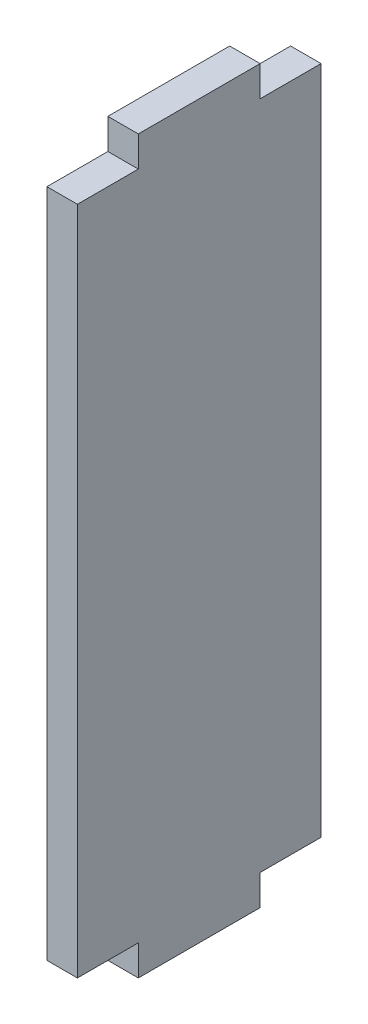
ISO-10303-21;
HEADER;
FILE_DESCRIPTION(('STEP AP214'),'2;1');
FILE_NAME('part.step','',(''),(''),'','','');
FILE_SCHEMA(('AUTOMOTIVE_DESIGN { 1 0 10303 214 1 1 1 1 }'));
ENDSEC;
DATA;
#1=APPLICATION_CONTEXT('core data for automotive mechanical design processes');
#2=APPLICATION_PROTOCOL_DEFINITION('international standard','automotive_design',2000,#1);
#3=PRODUCT_CONTEXT('',#1,'mechanical');
#4=PRODUCT('Part','Part','',(#3));
#5=PRODUCT_RELATED_PRODUCT_CATEGORY('part','',(#4));
#6=PRODUCT_DEFINITION_FORMATION('','',#4);
#7=PRODUCT_DEFINITION_CONTEXT('part definition',#1,'design');
#8=PRODUCT_DEFINITION('design','',#6,#7);
#9=PRODUCT_DEFINITION_SHAPE('','',#8);
#10=(LENGTH_UNIT() NAMED_UNIT(*) SI_UNIT(.MILLI.,.METRE.));
#11=(NAMED_UNIT(*) PLANE_ANGLE_UNIT() SI_UNIT($,.RADIAN.));
#12=(NAMED_UNIT(*) SI_UNIT($,.STERADIAN.) SOLID_ANGLE_UNIT());
#13=UNCERTAINTY_MEASURE_WITH_UNIT(LENGTH_MEASURE(1.E-05),#10,'distance_accuracy_value','');
#14=(GEOMETRIC_REPRESENTATION_CONTEXT(3) GLOBAL_UNCERTAINTY_ASSIGNED_CONTEXT((#13)) GLOBAL_UNIT_ASSIGNED_CONTEXT((#10,
#11,#12)) REPRESENTATION_CONTEXT('',''));
#15=CARTESIAN_POINT('',(0.,0.,0.));
#16=DIRECTION('',(0.,0.,1.));
#17=DIRECTION('',(1.,0.,0.));
#18=AXIS2_PLACEMENT_3D('',#15,#16,#17);
#19=CARTESIAN_POINT('',(5.,-65.,-10.));
#20=DIRECTION('',(0.,1.,0.));
#21=DIRECTION('',(0.,0.,1.));
#22=AXIS2_PLACEMENT_3D('',#19,#20,#21);
#23=PLANE('',#22);
#24=DIRECTION('',(0.,0.,-1.));
#25=VECTOR('',#24,1.);
#26=CARTESIAN_POINT('',(0.,-65.,-10.));
#27=LINE('',#26,#25);
#28=CARTESIAN_POINT('',(0.,-65.,-10.));
#29=VERTEX_POINT('',#28);
#30=CARTESIAN_POINT('',(0.,-65.,-20.));
#31=VERTEX_POINT('',#30);
#32=EDGE_CURVE('E166',#29,#31,#27,.T.);
#33=ORIENTED_EDGE('',*,*,#32,.T.);
#34=DIRECTION('',(-1.,0.,0.));
#35=VECTOR('',#34,1.);
#36=CARTESIAN_POINT('',(5.,-65.,-20.));
#37=LINE('',#36,#35);
#38=CARTESIAN_POINT('',(5.,-65.,-20.));
#39=VERTEX_POINT('',#38);
#40=EDGE_CURVE('E11',#39,#31,#37,.T.);
#41=ORIENTED_EDGE('',*,*,#40,.F.);
#42=DIRECTION('',(0.,0.,-1.));
#43=VECTOR('',#42,1.);
#44=CARTESIAN_POINT('',(5.,-65.,-10.));
#45=LINE('',#44,#43);
#46=CARTESIAN_POINT('',(5.,-65.,-10.));
#47=VERTEX_POINT('',#46);
#48=EDGE_CURVE('E200',#47,#39,#45,.T.);
#49=ORIENTED_EDGE('',*,*,#48,.F.);
#50=DIRECTION('',(-1.,0.,0.));
#51=VECTOR('',#50,1.);
#52=CARTESIAN_POINT('',(5.,-65.,-10.));
#53=LINE('',#52,#51);
#54=EDGE_CURVE('E162',#47,#29,#53,.T.);
#55=ORIENTED_EDGE('',*,*,#54,.T.);
#56=EDGE_LOOP('',(#33,#41,#49,#55));
#57=FACE_BOUND('',#56,.T.);
#58=ADVANCED_FACE('F41',(#57),#23,.F.);
#59=CARTESIAN_POINT('',(5.,45.,-20.));
#60=DIRECTION('',(0.,0.,1.));
#61=DIRECTION('',(0.,-1.,0.));
#62=AXIS2_PLACEMENT_3D('',#59,#60,#61);
#63=PLANE('',#62);
#64=DIRECTION('',(0.,1.,0.));
#65=VECTOR('',#64,1.);
#66=CARTESIAN_POINT('',(0.,45.,-20.));
#67=LINE('',#66,#65);
#68=CARTESIAN_POINT('',(0.,45.,-20.));
#69=VERTEX_POINT('',#68);
#70=EDGE_CURVE('E170',#31,#69,#67,.T.);
#71=ORIENTED_EDGE('',*,*,#70,.T.);
#72=DIRECTION('',(-1.,0.,0.));
#73=VECTOR('',#72,1.);
#74=CARTESIAN_POINT('',(5.,45.,-20.));
#75=LINE('',#74,#73);
#76=CARTESIAN_POINT('',(5.,45.,-20.));
#77=VERTEX_POINT('',#76);
#78=EDGE_CURVE('E50',#77,#69,#75,.T.);
#79=ORIENTED_EDGE('',*,*,#78,.F.);
#80=DIRECTION('',(0.,1.,0.));
#81=VECTOR('',#80,1.);
#82=CARTESIAN_POINT('',(5.,45.,-20.));
#83=LINE('',#82,#81);
#84=EDGE_CURVE('E113',#39,#77,#83,.T.);
#85=ORIENTED_EDGE('',*,*,#84,.F.);
#86=ORIENTED_EDGE('',*,*,#40,.T.);
#87=EDGE_LOOP('',(#71,#79,#85,#86));
#88=FACE_BOUND('',#87,.T.);
#89=ADVANCED_FACE('F294',(#88),#63,.F.);
#90=CARTESIAN_POINT('',(5.,45.,-10.));
#91=DIRECTION('',(0.,-1.,0.));
#92=DIRECTION('',(0.,0.,-1.));
#93=AXIS2_PLACEMENT_3D('',#90,#91,#92);
#94=PLANE('',#93);
#95=DIRECTION('',(0.,0.,1.));
#96=VECTOR('',#95,1.);
#97=CARTESIAN_POINT('',(0.,45.,-10.));
#98=LINE('',#97,#96);
#99=CARTESIAN_POINT('',(0.,45.,-10.));
#100=VERTEX_POINT('',#99);
#101=EDGE_CURVE('E173',#69,#100,#98,.T.);
#102=ORIENTED_EDGE('',*,*,#101,.T.);
#103=DIRECTION('',(-1.,0.,0.));
#104=VECTOR('',#103,1.);
#105=CARTESIAN_POINT('',(5.,45.,-10.));
#106=LINE('',#105,#104);
#107=CARTESIAN_POINT('',(5.,45.,-10.));
#108=VERTEX_POINT('',#107);
#109=EDGE_CURVE('E227',#108,#100,#106,.T.);
#110=ORIENTED_EDGE('',*,*,#109,.F.);
#111=DIRECTION('',(0.,0.,1.));
#112=VECTOR('',#111,1.);
#113=CARTESIAN_POINT('',(5.,45.,-10.));
#114=LINE('',#113,#112);
#115=EDGE_CURVE('E237',#77,#108,#114,.T.);
#116=ORIENTED_EDGE('',*,*,#115,.F.);
#117=ORIENTED_EDGE('',*,*,#78,.T.);
#118=EDGE_LOOP('',(#102,#110,#116,#117));
#119=FACE_BOUND('',#118,.T.);
#120=ADVANCED_FACE('F235',(#119),#94,.F.);
#121=CARTESIAN_POINT('',(5.,50.,-10.));
#122=DIRECTION('',(0.,0.,1.));
#123=DIRECTION('',(1.,0.,0.));
#124=AXIS2_PLACEMENT_3D('',#121,#122,#123);
#125=PLANE('',#124);
#126=DIRECTION('',(0.,1.,0.));
#127=VECTOR('',#126,1.);
#128=CARTESIAN_POINT('',(0.,50.,-10.));
#129=LINE('',#128,#127);
#130=CARTESIAN_POINT('',(0.,50.,-10.));
#131=VERTEX_POINT('',#130);
#132=EDGE_CURVE('E176',#100,#131,#129,.T.);
#133=ORIENTED_EDGE('',*,*,#132,.T.);
#134=DIRECTION('',(-1.,0.,0.));
#135=VECTOR('',#134,1.);
#136=CARTESIAN_POINT('',(5.,50.,-10.));
#137=LINE('',#136,#135);
#138=CARTESIAN_POINT('',(5.,50.,-10.));
#139=VERTEX_POINT('',#138);
#140=EDGE_CURVE('E223',#139,#131,#137,.T.);
#141=ORIENTED_EDGE('',*,*,#140,.F.);
#142=DIRECTION('',(0.,1.,0.));
#143=VECTOR('',#142,1.);
#144=CARTESIAN_POINT('',(5.,50.,-10.));
#145=LINE('',#144,#143);
#146=EDGE_CURVE('E256',#108,#139,#145,.T.);
#147=ORIENTED_EDGE('',*,*,#146,.F.);
#148=ORIENTED_EDGE('',*,*,#109,.T.);
#149=EDGE_LOOP('',(#133,#141,#147,#148));
#150=FACE_BOUND('',#149,.T.);
#151=ADVANCED_FACE('F246',(#150),#125,.F.);
#152=CARTESIAN_POINT('',(5.,50.,10.));
#153=DIRECTION('',(0.,-1.,0.));
#154=DIRECTION('',(0.,0.,-1.));
#155=AXIS2_PLACEMENT_3D('',#152,#153,#154);
#156=PLANE('',#155);
#157=DIRECTION('',(0.,0.,1.));
#158=VECTOR('',#157,1.);
#159=CARTESIAN_POINT('',(0.,50.,10.));
#160=LINE('',#159,#158);
#161=CARTESIAN_POINT('',(0.,50.,10.));
#162=VERTEX_POINT('',#161);
#163=EDGE_CURVE('E179',#131,#162,#160,.T.);
#164=ORIENTED_EDGE('',*,*,#163,.T.);
#165=DIRECTION('',(-1.,0.,0.));
#166=VECTOR('',#165,1.);
#167=CARTESIAN_POINT('',(5.,50.,10.));
#168=LINE('',#167,#166);
#169=CARTESIAN_POINT('',(5.,50.,10.));
#170=VERTEX_POINT('',#169);
#171=EDGE_CURVE('E219',#170,#162,#168,.T.);
#172=ORIENTED_EDGE('',*,*,#171,.F.);
#173=DIRECTION('',(0.,0.,1.));
#174=VECTOR('',#173,1.);
#175=CARTESIAN_POINT('',(5.,50.,10.));
#176=LINE('',#175,#174);
#177=EDGE_CURVE('E252',#139,#170,#176,.T.);
#178=ORIENTED_EDGE('',*,*,#177,.F.);
#179=ORIENTED_EDGE('',*,*,#140,.T.);
#180=EDGE_LOOP('',(#164,#172,#178,#179));
#181=FACE_BOUND('',#180,.T.);
#182=ADVANCED_FACE('F250',(#181),#156,.F.);
#183=CARTESIAN_POINT('',(5.,45.,10.));
#184=DIRECTION('',(0.,0.,-1.));
#185=DIRECTION('',(-1.,0.,0.));
#186=AXIS2_PLACEMENT_3D('',#183,#184,#185);
#187=PLANE('',#186);
#188=DIRECTION('',(0.,-1.,0.));
#189=VECTOR('',#188,1.);
#190=CARTESIAN_POINT('',(0.,45.,10.));
#191=LINE('',#190,#189);
#192=CARTESIAN_POINT('',(0.,45.,10.));
#193=VERTEX_POINT('',#192);
#194=EDGE_CURVE('E182',#162,#193,#191,.T.);
#195=ORIENTED_EDGE('',*,*,#194,.T.);
#196=DIRECTION('',(-1.,0.,0.));
#197=VECTOR('',#196,1.);
#198=CARTESIAN_POINT('',(5.,45.,10.));
#199=LINE('',#198,#197);
#200=CARTESIAN_POINT('',(5.,45.,10.));
#201=VERTEX_POINT('',#200);
#202=EDGE_CURVE('E215',#201,#193,#199,.T.);
#203=ORIENTED_EDGE('',*,*,#202,.F.);
#204=DIRECTION('',(0.,-1.,0.));
#205=VECTOR('',#204,1.);
#206=CARTESIAN_POINT('',(5.,45.,10.));
#207=LINE('',#206,#205);
#208=EDGE_CURVE('E255',#170,#201,#207,.T.);
#209=ORIENTED_EDGE('',*,*,#208,.F.);
#210=ORIENTED_EDGE('',*,*,#171,.T.);
#211=EDGE_LOOP('',(#195,#203,#209,#210));
#212=FACE_BOUND('',#211,.T.);
#213=ADVANCED_FACE('F307',(#212),#187,.F.);
#214=CARTESIAN_POINT('',(5.,45.,20.));
#215=DIRECTION('',(0.,-1.,0.));
#216=DIRECTION('',(0.,0.,-1.));
#217=AXIS2_PLACEMENT_3D('',#214,#215,#216);
#218=PLANE('',#217);
#219=DIRECTION('',(0.,0.,1.));
#220=VECTOR('',#219,1.);
#221=CARTESIAN_POINT('',(0.,45.,20.));
#222=LINE('',#221,#220);
#223=CARTESIAN_POINT('',(0.,45.,20.));
#224=VERTEX_POINT('',#223);
#225=EDGE_CURVE('E185',#193,#224,#222,.T.);
#226=ORIENTED_EDGE('',*,*,#225,.T.);
#227=DIRECTION('',(-1.,0.,0.));
#228=VECTOR('',#227,1.);
#229=CARTESIAN_POINT('',(5.,45.,20.));
#230=LINE('',#229,#228);
#231=CARTESIAN_POINT('',(5.,45.,20.));
#232=VERTEX_POINT('',#231);
#233=EDGE_CURVE('E211',#232,#224,#230,.T.);
#234=ORIENTED_EDGE('',*,*,#233,.F.);
#235=DIRECTION('',(0.,0.,1.));
#236=VECTOR('',#235,1.);
#237=CARTESIAN_POINT('',(5.,45.,20.));
#238=LINE('',#237,#236);
#239=EDGE_CURVE('E260',#201,#232,#238,.T.);
#240=ORIENTED_EDGE('',*,*,#239,.F.);
#241=ORIENTED_EDGE('',*,*,#202,.T.);
#242=EDGE_LOOP('',(#226,#234,#240,#241));
#243=FACE_BOUND('',#242,.T.);
#244=ADVANCED_FACE('F310',(#243),#218,.F.);
#245=CARTESIAN_POINT('',(5.,45.,20.));
#246=DIRECTION('',(0.,0.,-1.));
#247=DIRECTION('',(-1.,0.,0.));
#248=AXIS2_PLACEMENT_3D('',#245,#246,#247);
#249=PLANE('',#248);
#250=DIRECTION('',(0.,-1.,0.));
#251=VECTOR('',#250,1.);
#252=CARTESIAN_POINT('',(0.,45.,20.));
#253=LINE('',#252,#251);
#254=CARTESIAN_POINT('',(0.,-65.,20.));
#255=VERTEX_POINT('',#254);
#256=EDGE_CURVE('E188',#224,#255,#253,.T.);
#257=ORIENTED_EDGE('',*,*,#256,.T.);
#258=DIRECTION('',(-1.,0.,0.));
#259=VECTOR('',#258,1.);
#260=CARTESIAN_POINT('',(5.,-65.,20.));
#261=LINE('',#260,#259);
#262=CARTESIAN_POINT('',(5.,-65.,20.));
#263=VERTEX_POINT('',#262);
#264=EDGE_CURVE('E207',#263,#255,#261,.T.);
#265=ORIENTED_EDGE('',*,*,#264,.F.);
#266=DIRECTION('',(0.,-1.,0.));
#267=VECTOR('',#266,1.);
#268=CARTESIAN_POINT('',(5.,45.,20.));
#269=LINE('',#268,#267);
#270=EDGE_CURVE('E267',#232,#263,#269,.T.);
#271=ORIENTED_EDGE('',*,*,#270,.F.);
#272=ORIENTED_EDGE('',*,*,#233,.T.);
#273=EDGE_LOOP('',(#257,#265,#271,#272));
#274=FACE_BOUND('',#273,.T.);
#275=ADVANCED_FACE('F275',(#274),#249,.F.);
#276=CARTESIAN_POINT('',(5.,-65.,20.));
#277=DIRECTION('',(0.,1.,0.));
#278=DIRECTION('',(0.,0.,1.));
#279=AXIS2_PLACEMENT_3D('',#276,#277,#278);
#280=PLANE('',#279);
#281=DIRECTION('',(0.,0.,-1.));
#282=VECTOR('',#281,1.);
#283=CARTESIAN_POINT('',(0.,-65.,20.));
#284=LINE('',#283,#282);
#285=CARTESIAN_POINT('',(0.,-65.,9.99999999999997));
#286=VERTEX_POINT('',#285);
#287=EDGE_CURVE('E191',#255,#286,#284,.T.);
#288=ORIENTED_EDGE('',*,*,#287,.T.);
#289=DIRECTION('',(-1.,0.,0.));
#290=VECTOR('',#289,1.);
#291=CARTESIAN_POINT('',(5.,-65.,9.99999999999997));
#292=LINE('',#291,#290);
#293=CARTESIAN_POINT('',(5.,-65.,9.99999999999997));
#294=VERTEX_POINT('',#293);
#295=EDGE_CURVE('E155',#294,#286,#292,.T.);
#296=ORIENTED_EDGE('',*,*,#295,.F.);
#297=DIRECTION('',(0.,0.,-1.));
#298=VECTOR('',#297,1.);
#299=CARTESIAN_POINT('',(5.,-65.,20.));
#300=LINE('',#299,#298);
#301=EDGE_CURVE('E144',#263,#294,#300,.T.);
#302=ORIENTED_EDGE('',*,*,#301,.F.);
#303=ORIENTED_EDGE('',*,*,#264,.T.);
#304=EDGE_LOOP('',(#288,#296,#302,#303));
#305=FACE_BOUND('',#304,.T.);
#306=ADVANCED_FACE('F279',(#305),#280,.F.);
#307=CARTESIAN_POINT('',(5.,-70.,9.99999999999997));
#308=DIRECTION('',(0.,0.,-1.));
#309=DIRECTION('',(-1.,0.,0.));
#310=AXIS2_PLACEMENT_3D('',#307,#308,#309);
#311=PLANE('',#310);
#312=DIRECTION('',(0.,-1.,0.));
#313=VECTOR('',#312,1.);
#314=CARTESIAN_POINT('',(0.,-70.,9.99999999999997));
#315=LINE('',#314,#313);
#316=CARTESIAN_POINT('',(0.,-70.,9.99999999999997));
#317=VERTEX_POINT('',#316);
#318=EDGE_CURVE('E153',#286,#317,#315,.T.);
#319=ORIENTED_EDGE('',*,*,#318,.T.);
#320=DIRECTION('',(-1.,0.,0.));
#321=VECTOR('',#320,1.);
#322=CARTESIAN_POINT('',(5.,-70.,9.99999999999997));
#323=LINE('',#322,#321);
#324=CARTESIAN_POINT('',(5.,-70.,9.99999999999997));
#325=VERTEX_POINT('',#324);
#326=EDGE_CURVE('E150',#325,#317,#323,.T.);
#327=ORIENTED_EDGE('',*,*,#326,.F.);
#328=DIRECTION('',(0.,-1.,0.));
#329=VECTOR('',#328,1.);
#330=CARTESIAN_POINT('',(5.,-70.,9.99999999999997));
#331=LINE('',#330,#329);
#332=EDGE_CURVE('E138',#294,#325,#331,.T.);
#333=ORIENTED_EDGE('',*,*,#332,.F.);
#334=ORIENTED_EDGE('',*,*,#295,.T.);
#335=EDGE_LOOP('',(#319,#327,#333,#334));
#336=FACE_BOUND('',#335,.T.);
#337=ADVANCED_FACE('F151',(#336),#311,.F.);
#338=CARTESIAN_POINT('',(5.,-70.,-10.));
#339=DIRECTION('',(0.,1.,0.));
#340=DIRECTION('',(0.,0.,1.));
#341=AXIS2_PLACEMENT_3D('',#338,#339,#340);
#342=PLANE('',#341);
#343=DIRECTION('',(0.,0.,-1.));
#344=VECTOR('',#343,1.);
#345=CARTESIAN_POINT('',(0.,-70.,-10.));
#346=LINE('',#345,#344);
#347=CARTESIAN_POINT('',(0.,-70.,-10.));
#348=VERTEX_POINT('',#347);
#349=EDGE_CURVE('E99',#317,#348,#346,.T.);
#350=ORIENTED_EDGE('',*,*,#349,.T.);
#351=DIRECTION('',(-1.,0.,0.));
#352=VECTOR('',#351,1.);
#353=CARTESIAN_POINT('',(5.,-70.,-10.));
#354=LINE('',#353,#352);
#355=CARTESIAN_POINT('',(5.,-70.,-10.));
#356=VERTEX_POINT('',#355);
#357=EDGE_CURVE('E156',#356,#348,#354,.T.);
#358=ORIENTED_EDGE('',*,*,#357,.F.);
#359=DIRECTION('',(0.,0.,-1.));
#360=VECTOR('',#359,1.);
#361=CARTESIAN_POINT('',(5.,-70.,-10.));
#362=LINE('',#361,#360);
#363=EDGE_CURVE('E142',#325,#356,#362,.T.);
#364=ORIENTED_EDGE('',*,*,#363,.F.);
#365=ORIENTED_EDGE('',*,*,#326,.T.);
#366=EDGE_LOOP('',(#350,#358,#364,#365));
#367=FACE_BOUND('',#366,.T.);
#368=ADVANCED_FACE('F158',(#367),#342,.F.);
#369=CARTESIAN_POINT('',(5.,-65.,-10.));
#370=DIRECTION('',(0.,0.,1.));
#371=DIRECTION('',(0.,-1.,0.));
#372=AXIS2_PLACEMENT_3D('',#369,#370,#371);
#373=PLANE('',#372);
#374=DIRECTION('',(0.,1.,0.));
#375=VECTOR('',#374,1.);
#376=CARTESIAN_POINT('',(0.,-65.,-10.));
#377=LINE('',#376,#375);
#378=EDGE_CURVE('E105',#348,#29,#377,.T.);
#379=ORIENTED_EDGE('',*,*,#378,.T.);
#380=ORIENTED_EDGE('',*,*,#54,.F.);
#381=DIRECTION('',(0.,1.,0.));
#382=VECTOR('',#381,1.);
#383=CARTESIAN_POINT('',(5.,-65.,-10.));
#384=LINE('',#383,#382);
#385=EDGE_CURVE('E58',#356,#47,#384,.T.);
#386=ORIENTED_EDGE('',*,*,#385,.F.);
#387=ORIENTED_EDGE('',*,*,#357,.T.);
#388=EDGE_LOOP('',(#379,#380,#386,#387));
#389=FACE_BOUND('',#388,.T.);
#390=ADVANCED_FACE('F283',(#389),#373,.F.);
#391=CARTESIAN_POINT('',(5.,0.,0.));
#392=DIRECTION('',(-1.,0.,0.));
#393=DIRECTION('',(0.,0.,1.));
#394=AXIS2_PLACEMENT_3D('',#391,#392,#393);
#395=PLANE('',#394);
#396=ORIENTED_EDGE('',*,*,#48,.T.);
#397=ORIENTED_EDGE('',*,*,#84,.T.);
#398=ORIENTED_EDGE('',*,*,#115,.T.);
#399=ORIENTED_EDGE('',*,*,#146,.T.);
#400=ORIENTED_EDGE('',*,*,#177,.T.);
#401=ORIENTED_EDGE('',*,*,#208,.T.);
#402=ORIENTED_EDGE('',*,*,#239,.T.);
#403=ORIENTED_EDGE('',*,*,#270,.T.);
#404=ORIENTED_EDGE('',*,*,#301,.T.);
#405=ORIENTED_EDGE('',*,*,#332,.T.);
#406=ORIENTED_EDGE('',*,*,#363,.T.);
#407=ORIENTED_EDGE('',*,*,#385,.T.);
#408=EDGE_LOOP('',(#396,#397,#398,#399,#400,#401,#402,#403,#404,#405,#406,#407));
#409=FACE_BOUND('',#408,.T.);
#410=ADVANCED_FACE('F140',(#409),#395,.F.);
#411=CARTESIAN_POINT('',(0.,0.,0.));
#412=DIRECTION('',(-1.,0.,0.));
#413=DIRECTION('',(0.,0.,1.));
#414=AXIS2_PLACEMENT_3D('',#411,#412,#413);
#415=PLANE('',#414);
#416=ORIENTED_EDGE('',*,*,#32,.F.);
#417=ORIENTED_EDGE('',*,*,#378,.F.);
#418=ORIENTED_EDGE('',*,*,#349,.F.);
#419=ORIENTED_EDGE('',*,*,#318,.F.);
#420=ORIENTED_EDGE('',*,*,#287,.F.);
#421=ORIENTED_EDGE('',*,*,#256,.F.);
#422=ORIENTED_EDGE('',*,*,#225,.F.);
#423=ORIENTED_EDGE('',*,*,#194,.F.);
#424=ORIENTED_EDGE('',*,*,#163,.F.);
#425=ORIENTED_EDGE('',*,*,#132,.F.);
#426=ORIENTED_EDGE('',*,*,#101,.F.);
#427=ORIENTED_EDGE('',*,*,#70,.F.);
#428=EDGE_LOOP('',(#416,#417,#418,#419,#420,#421,#422,#423,#424,#425,#426,#427));
#429=FACE_BOUND('',#428,.T.);
#430=ADVANCED_FACE('F241',(#429),#415,.T.);
#431=CLOSED_SHELL('',(#58,#89,#120,#151,#182,#213,#244,#275,#306,#337,#368,#390,#410,#430));
#432=MANIFOLD_SOLID_BREP('B2',#431);
#433=ADVANCED_BREP_SHAPE_REPRESENTATION('',(#18,#432),#14);
#434=SHAPE_DEFINITION_REPRESENTATION(#9,#433);
ENDSEC;
END-ISO-10303-21;
